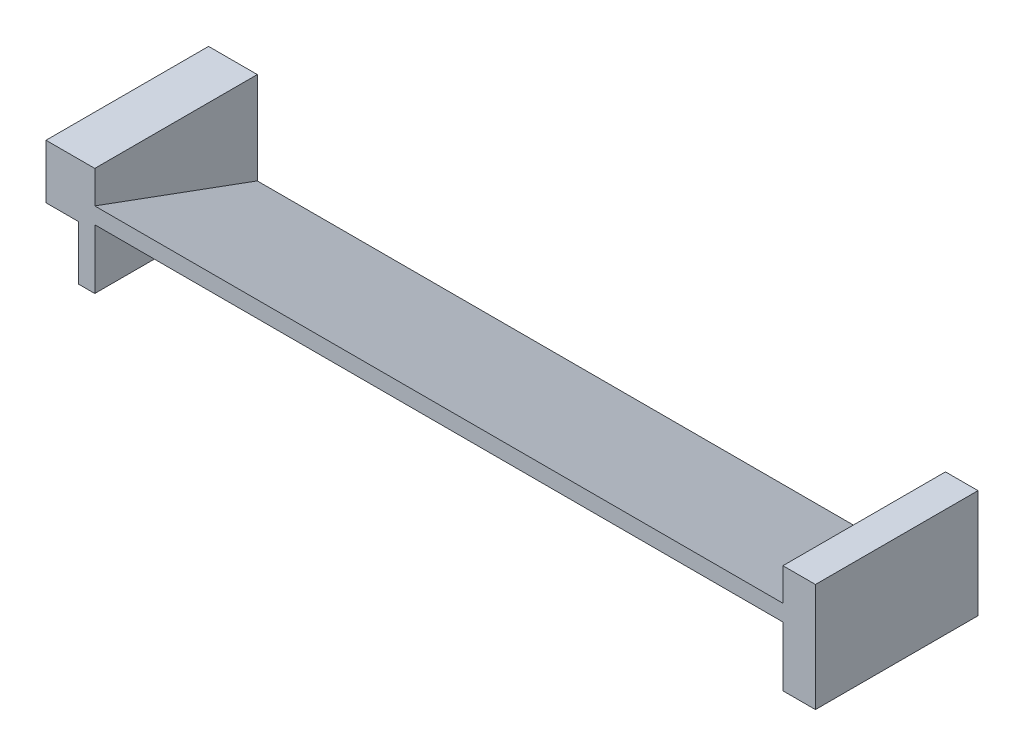
ISO-10303-21;
HEADER;
FILE_DESCRIPTION(('STEP AP214'),'2;1');
FILE_NAME('part.step','',(''),(''),'','','');
FILE_SCHEMA(('AUTOMOTIVE_DESIGN { 1 0 10303 214 1 1 1 1 }'));
ENDSEC;
DATA;
#1=APPLICATION_CONTEXT('core data for automotive mechanical design processes');
#2=APPLICATION_PROTOCOL_DEFINITION('international standard','automotive_design',2000,#1);
#3=PRODUCT_CONTEXT('',#1,'mechanical');
#4=PRODUCT('Part','Part','',(#3));
#5=PRODUCT_RELATED_PRODUCT_CATEGORY('part','',(#4));
#6=PRODUCT_DEFINITION_FORMATION('','',#4);
#7=PRODUCT_DEFINITION_CONTEXT('part definition',#1,'design');
#8=PRODUCT_DEFINITION('design','',#6,#7);
#9=PRODUCT_DEFINITION_SHAPE('','',#8);
#10=(LENGTH_UNIT() NAMED_UNIT(*) SI_UNIT(.MILLI.,.METRE.));
#11=(NAMED_UNIT(*) PLANE_ANGLE_UNIT() SI_UNIT($,.RADIAN.));
#12=(NAMED_UNIT(*) SI_UNIT($,.STERADIAN.) SOLID_ANGLE_UNIT());
#13=UNCERTAINTY_MEASURE_WITH_UNIT(LENGTH_MEASURE(1.E-05),#10,'distance_accuracy_value','');
#14=(GEOMETRIC_REPRESENTATION_CONTEXT(3) GLOBAL_UNCERTAINTY_ASSIGNED_CONTEXT((#13)) GLOBAL_UNIT_ASSIGNED_CONTEXT((#10,
#11,#12)) REPRESENTATION_CONTEXT('',''));
#15=CARTESIAN_POINT('',(0.,0.,0.));
#16=DIRECTION('',(0.,0.,1.));
#17=DIRECTION('',(1.,0.,0.));
#18=AXIS2_PLACEMENT_3D('',#15,#16,#17);
#19=CARTESIAN_POINT('',(65.,-10.,15.));
#20=DIRECTION('',(-1.,0.,0.));
#21=DIRECTION('',(0.,0.,1.));
#22=AXIS2_PLACEMENT_3D('',#19,#20,#21);
#23=PLANE('',#22);
#24=DIRECTION('',(0.,0.344254649158423,0.938876315886608));
#25=VECTOR('',#24,1.);
#26=CARTESIAN_POINT('',(65.,-9.,15.));
#27=LINE('',#26,#25);
#28=CARTESIAN_POINT('',(65.,-20.,-15.));
#29=VERTEX_POINT('',#28);
#30=CARTESIAN_POINT('',(65.,-9.,15.));
#31=VERTEX_POINT('',#30);
#32=EDGE_CURVE('E216',#29,#31,#27,.T.);
#33=ORIENTED_EDGE('',*,*,#32,.F.);
#34=DIRECTION('',(0.,0.,-1.));
#35=VECTOR('',#34,1.);
#36=CARTESIAN_POINT('',(65.,-20.,15.));
#37=LINE('',#36,#35);
#38=CARTESIAN_POINT('',(65.,-20.,15.));
#39=VERTEX_POINT('',#38);
#40=EDGE_CURVE('E220',#39,#29,#37,.T.);
#41=ORIENTED_EDGE('',*,*,#40,.F.);
#42=DIRECTION('',(0.,1.,0.));
#43=VECTOR('',#42,1.);
#44=CARTESIAN_POINT('',(65.,-10.,15.));
#45=LINE('',#44,#43);
#46=EDGE_CURVE('E69',#39,#31,#45,.T.);
#47=ORIENTED_EDGE('',*,*,#46,.T.);
#48=EDGE_LOOP('',(#33,#41,#47));
#49=FACE_BOUND('',#48,.T.);
#50=ADVANCED_FACE('F45',(#49),#23,.T.);
#51=CARTESIAN_POINT('',(71.,-10.,15.));
#52=DIRECTION('',(1.,0.,0.));
#53=DIRECTION('',(0.,0.,-1.));
#54=AXIS2_PLACEMENT_3D('',#51,#52,#53);
#55=PLANE('',#54);
#56=DIRECTION('',(0.,0.,-1.));
#57=VECTOR('',#56,1.);
#58=CARTESIAN_POINT('',(71.,0.,15.));
#59=LINE('',#58,#57);
#60=CARTESIAN_POINT('',(71.,0.,15.));
#61=VERTEX_POINT('',#60);
#62=CARTESIAN_POINT('',(71.,0.,-15.));
#63=VERTEX_POINT('',#62);
#64=EDGE_CURVE('E11',#61,#63,#59,.T.);
#65=ORIENTED_EDGE('',*,*,#64,.F.);
#66=DIRECTION('',(0.,1.,0.));
#67=VECTOR('',#66,1.);
#68=CARTESIAN_POINT('',(71.,-10.,15.));
#69=LINE('',#68,#67);
#70=CARTESIAN_POINT('',(71.,-20.,15.));
#71=VERTEX_POINT('',#70);
#72=EDGE_CURVE('E252',#71,#61,#69,.T.);
#73=ORIENTED_EDGE('',*,*,#72,.F.);
#74=DIRECTION('',(0.,0.,1.));
#75=VECTOR('',#74,1.);
#76=CARTESIAN_POINT('',(71.,-20.,15.));
#77=LINE('',#76,#75);
#78=CARTESIAN_POINT('',(71.,-20.,-15.));
#79=VERTEX_POINT('',#78);
#80=EDGE_CURVE('E244',#79,#71,#77,.T.);
#81=ORIENTED_EDGE('',*,*,#80,.F.);
#82=DIRECTION('',(0.,1.,0.));
#83=VECTOR('',#82,1.);
#84=CARTESIAN_POINT('',(71.,-10.,-15.));
#85=LINE('',#84,#83);
#86=EDGE_CURVE('E253',#79,#63,#85,.T.);
#87=ORIENTED_EDGE('',*,*,#86,.T.);
#88=EDGE_LOOP('',(#65,#73,#81,#87));
#89=FACE_BOUND('',#88,.T.);
#90=ADVANCED_FACE('F328',(#89),#55,.T.);
#91=CARTESIAN_POINT('',(71.,-10.,15.));
#92=DIRECTION('',(0.,0.,1.));
#93=DIRECTION('',(1.,0.,0.));
#94=AXIS2_PLACEMENT_3D('',#91,#92,#93);
#95=PLANE('',#94);
#96=DIRECTION('',(1.,0.,0.));
#97=VECTOR('',#96,1.);
#98=CARTESIAN_POINT('',(71.,0.,15.));
#99=LINE('',#98,#97);
#100=CARTESIAN_POINT('',(65.,0.,15.));
#101=VERTEX_POINT('',#100);
#102=EDGE_CURVE('E256',#101,#61,#99,.T.);
#103=ORIENTED_EDGE('',*,*,#102,.F.);
#104=CARTESIAN_POINT('',(65.,-6.,15.));
#105=VERTEX_POINT('',#104);
#106=EDGE_CURVE('E262',#105,#101,#45,.T.);
#107=ORIENTED_EDGE('',*,*,#106,.F.);
#108=DIRECTION('',(1.,0.,0.));
#109=VECTOR('',#108,1.);
#110=CARTESIAN_POINT('',(-71.002,-6.,15.));
#111=LINE('',#110,#109);
#112=CARTESIAN_POINT('',(-62.,-5.99999999999999,15.));
#113=VERTEX_POINT('',#112);
#114=EDGE_CURVE('E226',#113,#105,#111,.T.);
#115=ORIENTED_EDGE('',*,*,#114,.F.);
#116=DIRECTION('',(0.,-1.,0.));
#117=VECTOR('',#116,1.);
#118=CARTESIAN_POINT('',(-62.,0.,15.));
#119=LINE('',#118,#117);
#120=CARTESIAN_POINT('',(-62.,0.,15.));
#121=VERTEX_POINT('',#120);
#122=EDGE_CURVE('E151',#121,#113,#119,.T.);
#123=ORIENTED_EDGE('',*,*,#122,.F.);
#124=DIRECTION('',(1.,0.,0.));
#125=VECTOR('',#124,1.);
#126=CARTESIAN_POINT('',(-71.,0.,15.));
#127=LINE('',#126,#125);
#128=CARTESIAN_POINT('',(-71.,0.,15.));
#129=VERTEX_POINT('',#128);
#130=EDGE_CURVE('E187',#129,#121,#127,.T.);
#131=ORIENTED_EDGE('',*,*,#130,.F.);
#132=DIRECTION('',(0.,1.,0.));
#133=VECTOR('',#132,1.);
#134=CARTESIAN_POINT('',(-71.,-10.,15.));
#135=LINE('',#134,#133);
#136=CARTESIAN_POINT('',(-71.,-10.,15.));
#137=VERTEX_POINT('',#136);
#138=EDGE_CURVE('E204',#137,#129,#135,.T.);
#139=ORIENTED_EDGE('',*,*,#138,.F.);
#140=DIRECTION('',(1.,0.,0.));
#141=VECTOR('',#140,1.);
#142=CARTESIAN_POINT('',(-71.,-10.,15.));
#143=LINE('',#142,#141);
#144=CARTESIAN_POINT('',(-65.,-10.,15.));
#145=VERTEX_POINT('',#144);
#146=EDGE_CURVE('E195',#137,#145,#143,.T.);
#147=ORIENTED_EDGE('',*,*,#146,.T.);
#148=DIRECTION('',(0.,-1.,0.));
#149=VECTOR('',#148,1.);
#150=CARTESIAN_POINT('',(-65.,0.,15.));
#151=LINE('',#150,#149);
#152=CARTESIAN_POINT('',(-65.,-20.,15.));
#153=VERTEX_POINT('',#152);
#154=EDGE_CURVE('E168',#145,#153,#151,.T.);
#155=ORIENTED_EDGE('',*,*,#154,.T.);
#156=DIRECTION('',(-1.,0.,0.));
#157=VECTOR('',#156,1.);
#158=CARTESIAN_POINT('',(-62.,-20.,15.));
#159=LINE('',#158,#157);
#160=CARTESIAN_POINT('',(-62.,-20.,15.));
#161=VERTEX_POINT('',#160);
#162=EDGE_CURVE('E158',#161,#153,#159,.T.);
#163=ORIENTED_EDGE('',*,*,#162,.F.);
#164=CARTESIAN_POINT('',(-62.,-8.99999999999999,15.));
#165=VERTEX_POINT('',#164);
#166=EDGE_CURVE('E141',#165,#161,#119,.T.);
#167=ORIENTED_EDGE('',*,*,#166,.F.);
#168=DIRECTION('',(1.,0.,0.));
#169=VECTOR('',#168,1.);
#170=CARTESIAN_POINT('',(-71.002,-9.,15.));
#171=LINE('',#170,#169);
#172=EDGE_CURVE('E215',#165,#31,#171,.T.);
#173=ORIENTED_EDGE('',*,*,#172,.T.);
#174=ORIENTED_EDGE('',*,*,#46,.F.);
#175=DIRECTION('',(-1.,0.,0.));
#176=VECTOR('',#175,1.);
#177=CARTESIAN_POINT('',(65.,-20.,15.));
#178=LINE('',#177,#176);
#179=EDGE_CURVE('E248',#71,#39,#178,.T.);
#180=ORIENTED_EDGE('',*,*,#179,.F.);
#181=ORIENTED_EDGE('',*,*,#72,.T.);
#182=EDGE_LOOP('',(#103,#107,#115,#123,#131,#139,#147,#155,#163,#167,#173,#174,#180,#181));
#183=FACE_BOUND('',#182,.T.);
#184=ADVANCED_FACE('F165',(#183),#95,.T.);
#185=DIRECTION('',(0.,-0.344254649158423,-0.938876315886608));
#186=VECTOR('',#185,1.);
#187=CARTESIAN_POINT('',(65.,-17.,-15.));
#188=LINE('',#187,#186);
#189=CARTESIAN_POINT('',(65.,-17.,-15.));
#190=VERTEX_POINT('',#189);
#191=EDGE_CURVE('E61',#105,#190,#188,.T.);
#192=ORIENTED_EDGE('',*,*,#191,.F.);
#193=ORIENTED_EDGE('',*,*,#106,.T.);
#194=DIRECTION('',(0.,0.,1.));
#195=VECTOR('',#194,1.);
#196=CARTESIAN_POINT('',(65.,0.,15.));
#197=LINE('',#196,#195);
#198=CARTESIAN_POINT('',(65.,0.,-15.));
#199=VERTEX_POINT('',#198);
#200=EDGE_CURVE('E268',#199,#101,#197,.T.);
#201=ORIENTED_EDGE('',*,*,#200,.F.);
#202=DIRECTION('',(0.,1.,0.));
#203=VECTOR('',#202,1.);
#204=CARTESIAN_POINT('',(65.,-10.,-15.));
#205=LINE('',#204,#203);
#206=EDGE_CURVE('E257',#190,#199,#205,.T.);
#207=ORIENTED_EDGE('',*,*,#206,.F.);
#208=EDGE_LOOP('',(#192,#193,#201,#207));
#209=FACE_BOUND('',#208,.T.);
#210=ADVANCED_FACE('F282',(#209),#23,.T.);
#211=CARTESIAN_POINT('',(71.,-10.,-15.));
#212=DIRECTION('',(0.,0.,-1.));
#213=DIRECTION('',(-1.,0.,0.));
#214=AXIS2_PLACEMENT_3D('',#211,#212,#213);
#215=PLANE('',#214);
#216=DIRECTION('',(-1.,0.,0.));
#217=VECTOR('',#216,1.);
#218=CARTESIAN_POINT('',(71.,0.,-15.));
#219=LINE('',#218,#217);
#220=EDGE_CURVE('E54',#63,#199,#219,.T.);
#221=ORIENTED_EDGE('',*,*,#220,.F.);
#222=ORIENTED_EDGE('',*,*,#86,.F.);
#223=DIRECTION('',(1.,0.,0.));
#224=VECTOR('',#223,1.);
#225=CARTESIAN_POINT('',(65.,-20.,-15.));
#226=LINE('',#225,#224);
#227=EDGE_CURVE('E240',#29,#79,#226,.T.);
#228=ORIENTED_EDGE('',*,*,#227,.F.);
#229=DIRECTION('',(1.,0.,0.));
#230=VECTOR('',#229,1.);
#231=CARTESIAN_POINT('',(-71.002,-20.,-15.));
#232=LINE('',#231,#230);
#233=CARTESIAN_POINT('',(-62.,-20.,-15.));
#234=VERTEX_POINT('',#233);
#235=EDGE_CURVE('E223',#234,#29,#232,.T.);
#236=ORIENTED_EDGE('',*,*,#235,.F.);
#237=DIRECTION('',(-1.,0.,0.));
#238=VECTOR('',#237,1.);
#239=CARTESIAN_POINT('',(-62.,-20.,-15.));
#240=LINE('',#239,#238);
#241=CARTESIAN_POINT('',(-65.,-20.,-15.));
#242=VERTEX_POINT('',#241);
#243=EDGE_CURVE('E160',#234,#242,#240,.T.);
#244=ORIENTED_EDGE('',*,*,#243,.T.);
#245=DIRECTION('',(0.,1.,0.));
#246=VECTOR('',#245,1.);
#247=CARTESIAN_POINT('',(-65.,0.,-15.));
#248=LINE('',#247,#246);
#249=CARTESIAN_POINT('',(-65.,-10.,-15.));
#250=VERTEX_POINT('',#249);
#251=EDGE_CURVE('E152',#242,#250,#248,.T.);
#252=ORIENTED_EDGE('',*,*,#251,.T.);
#253=DIRECTION('',(-1.,0.,0.));
#254=VECTOR('',#253,1.);
#255=CARTESIAN_POINT('',(-71.,-10.,-15.));
#256=LINE('',#255,#254);
#257=CARTESIAN_POINT('',(-71.,-10.,-15.));
#258=VERTEX_POINT('',#257);
#259=EDGE_CURVE('E186',#250,#258,#256,.T.);
#260=ORIENTED_EDGE('',*,*,#259,.T.);
#261=DIRECTION('',(0.,1.,0.));
#262=VECTOR('',#261,1.);
#263=CARTESIAN_POINT('',(-71.,-10.,-15.));
#264=LINE('',#263,#262);
#265=CARTESIAN_POINT('',(-71.,0.,-15.));
#266=VERTEX_POINT('',#265);
#267=EDGE_CURVE('E197',#258,#266,#264,.T.);
#268=ORIENTED_EDGE('',*,*,#267,.T.);
#269=DIRECTION('',(-1.,0.,0.));
#270=VECTOR('',#269,1.);
#271=CARTESIAN_POINT('',(-71.,0.,-15.));
#272=LINE('',#271,#270);
#273=CARTESIAN_POINT('',(-62.,0.,-15.));
#274=VERTEX_POINT('',#273);
#275=EDGE_CURVE('E171',#274,#266,#272,.T.);
#276=ORIENTED_EDGE('',*,*,#275,.F.);
#277=DIRECTION('',(0.,1.,0.));
#278=VECTOR('',#277,1.);
#279=CARTESIAN_POINT('',(-62.,-14.,-15.));
#280=LINE('',#279,#278);
#281=CARTESIAN_POINT('',(-62.,-17.,-15.));
#282=VERTEX_POINT('',#281);
#283=EDGE_CURVE('E162',#282,#274,#280,.T.);
#284=ORIENTED_EDGE('',*,*,#283,.F.);
#285=DIRECTION('',(1.,0.,0.));
#286=VECTOR('',#285,1.);
#287=CARTESIAN_POINT('',(-71.002,-17.,-15.));
#288=LINE('',#287,#286);
#289=EDGE_CURVE('E230',#282,#190,#288,.T.);
#290=ORIENTED_EDGE('',*,*,#289,.T.);
#291=ORIENTED_EDGE('',*,*,#206,.T.);
#292=EDGE_LOOP('',(#221,#222,#228,#236,#244,#252,#260,#268,#276,#284,#290,#291));
#293=FACE_BOUND('',#292,.T.);
#294=ADVANCED_FACE('F278',(#293),#215,.T.);
#295=CARTESIAN_POINT('',(0.,0.,0.));
#296=DIRECTION('',(0.,1.,0.));
#297=DIRECTION('',(0.,0.,1.));
#298=AXIS2_PLACEMENT_3D('',#295,#296,#297);
#299=PLANE('',#298);
#300=ORIENTED_EDGE('',*,*,#64,.T.);
#301=ORIENTED_EDGE('',*,*,#220,.T.);
#302=ORIENTED_EDGE('',*,*,#200,.T.);
#303=ORIENTED_EDGE('',*,*,#102,.T.);
#304=EDGE_LOOP('',(#300,#301,#302,#303));
#305=FACE_BOUND('',#304,.T.);
#306=ADVANCED_FACE('F47',(#305),#299,.T.);
#307=CARTESIAN_POINT('',(0.,-20.,0.));
#308=DIRECTION('',(0.,-1.,0.));
#309=DIRECTION('',(0.,0.,-1.));
#310=AXIS2_PLACEMENT_3D('',#307,#308,#309);
#311=PLANE('',#310);
#312=ORIENTED_EDGE('',*,*,#40,.T.);
#313=ORIENTED_EDGE('',*,*,#227,.T.);
#314=ORIENTED_EDGE('',*,*,#80,.T.);
#315=ORIENTED_EDGE('',*,*,#179,.T.);
#316=EDGE_LOOP('',(#312,#313,#314,#315));
#317=FACE_BOUND('',#316,.T.);
#318=ADVANCED_FACE('F365',(#317),#311,.T.);
#319=CARTESIAN_POINT('',(-71.002,-17.,-15.));
#320=DIRECTION('',(0.,-0.938876315886608,0.344254649158423));
#321=DIRECTION('',(0.,-0.344254649158424,-0.938876315886609));
#322=AXIS2_PLACEMENT_3D('',#319,#320,#321);
#323=PLANE('',#322);
#324=ORIENTED_EDGE('',*,*,#289,.F.);
#325=DIRECTION('',(0.,0.344254649158424,0.938876315886609));
#326=VECTOR('',#325,1.);
#327=CARTESIAN_POINT('',(-62.,-17.,-15.));
#328=LINE('',#327,#326);
#329=EDGE_CURVE('E211',#282,#113,#328,.T.);
#330=ORIENTED_EDGE('',*,*,#329,.T.);
#331=ORIENTED_EDGE('',*,*,#114,.T.);
#332=ORIENTED_EDGE('',*,*,#191,.T.);
#333=EDGE_LOOP('',(#324,#330,#331,#332));
#334=FACE_BOUND('',#333,.T.);
#335=ADVANCED_FACE('F287',(#334),#323,.F.);
#336=CARTESIAN_POINT('',(-71.002,-9.,15.));
#337=DIRECTION('',(0.,0.938876315886609,-0.344254649158423));
#338=DIRECTION('',(0.,0.344254649158423,0.938876315886609));
#339=AXIS2_PLACEMENT_3D('',#336,#337,#338);
#340=PLANE('',#339);
#341=ORIENTED_EDGE('',*,*,#172,.F.);
#342=DIRECTION('',(0.,-0.344254649158423,-0.938876315886609));
#343=VECTOR('',#342,1.);
#344=CARTESIAN_POINT('',(-62.,-9.,15.));
#345=LINE('',#344,#343);
#346=EDGE_CURVE('E146',#165,#234,#345,.T.);
#347=ORIENTED_EDGE('',*,*,#346,.T.);
#348=ORIENTED_EDGE('',*,*,#235,.T.);
#349=ORIENTED_EDGE('',*,*,#32,.T.);
#350=EDGE_LOOP('',(#341,#347,#348,#349));
#351=FACE_BOUND('',#350,.T.);
#352=ADVANCED_FACE('F364',(#351),#340,.F.);
#353=CARTESIAN_POINT('',(-62.,0.,0.));
#354=DIRECTION('',(1.,0.,0.));
#355=DIRECTION('',(0.,0.,-1.));
#356=AXIS2_PLACEMENT_3D('',#353,#354,#355);
#357=PLANE('',#356);
#358=ORIENTED_EDGE('',*,*,#329,.F.);
#359=ORIENTED_EDGE('',*,*,#283,.T.);
#360=DIRECTION('',(0.,0.,1.));
#361=VECTOR('',#360,1.);
#362=CARTESIAN_POINT('',(-62.,0.,15.));
#363=LINE('',#362,#361);
#364=EDGE_CURVE('E178',#274,#121,#363,.T.);
#365=ORIENTED_EDGE('',*,*,#364,.T.);
#366=ORIENTED_EDGE('',*,*,#122,.T.);
#367=EDGE_LOOP('',(#358,#359,#365,#366));
#368=FACE_BOUND('',#367,.T.);
#369=ADVANCED_FACE('F289',(#368),#357,.T.);
#370=ORIENTED_EDGE('',*,*,#346,.F.);
#371=ORIENTED_EDGE('',*,*,#166,.T.);
#372=DIRECTION('',(0.,0.,-1.));
#373=VECTOR('',#372,1.);
#374=CARTESIAN_POINT('',(-62.,-20.,15.));
#375=LINE('',#374,#373);
#376=EDGE_CURVE('E144',#161,#234,#375,.T.);
#377=ORIENTED_EDGE('',*,*,#376,.T.);
#378=EDGE_LOOP('',(#370,#371,#377));
#379=FACE_BOUND('',#378,.T.);
#380=ADVANCED_FACE('F143',(#379),#357,.T.);
#381=CARTESIAN_POINT('',(-71.,-10.,15.));
#382=DIRECTION('',(-1.,0.,0.));
#383=DIRECTION('',(0.,0.,1.));
#384=AXIS2_PLACEMENT_3D('',#381,#382,#383);
#385=PLANE('',#384);
#386=DIRECTION('',(0.,0.,1.));
#387=VECTOR('',#386,1.);
#388=CARTESIAN_POINT('',(-71.,0.,15.));
#389=LINE('',#388,#387);
#390=EDGE_CURVE('E176',#266,#129,#389,.T.);
#391=ORIENTED_EDGE('',*,*,#390,.F.);
#392=ORIENTED_EDGE('',*,*,#267,.F.);
#393=DIRECTION('',(0.,0.,1.));
#394=VECTOR('',#393,1.);
#395=CARTESIAN_POINT('',(-71.,-10.,15.));
#396=LINE('',#395,#394);
#397=EDGE_CURVE('E191',#258,#137,#396,.T.);
#398=ORIENTED_EDGE('',*,*,#397,.T.);
#399=ORIENTED_EDGE('',*,*,#138,.T.);
#400=EDGE_LOOP('',(#391,#392,#398,#399));
#401=FACE_BOUND('',#400,.T.);
#402=ADVANCED_FACE('F314',(#401),#385,.T.);
#403=CARTESIAN_POINT('',(0.,-10.,0.));
#404=DIRECTION('',(0.,-1.,0.));
#405=DIRECTION('',(0.,0.,-1.));
#406=AXIS2_PLACEMENT_3D('',#403,#404,#405);
#407=PLANE('',#406);
#408=DIRECTION('',(0.,0.,-1.));
#409=VECTOR('',#408,1.);
#410=CARTESIAN_POINT('',(-65.,-10.,15.));
#411=LINE('',#410,#409);
#412=EDGE_CURVE('E182',#145,#250,#411,.T.);
#413=ORIENTED_EDGE('',*,*,#412,.F.);
#414=ORIENTED_EDGE('',*,*,#146,.F.);
#415=ORIENTED_EDGE('',*,*,#397,.F.);
#416=ORIENTED_EDGE('',*,*,#259,.F.);
#417=EDGE_LOOP('',(#413,#414,#415,#416));
#418=FACE_BOUND('',#417,.T.);
#419=ADVANCED_FACE('F309',(#418),#407,.T.);
#420=CARTESIAN_POINT('',(0.,0.,0.));
#421=DIRECTION('',(0.,-1.,0.));
#422=DIRECTION('',(0.,0.,-1.));
#423=AXIS2_PLACEMENT_3D('',#420,#421,#422);
#424=PLANE('',#423);
#425=ORIENTED_EDGE('',*,*,#130,.T.);
#426=ORIENTED_EDGE('',*,*,#364,.F.);
#427=ORIENTED_EDGE('',*,*,#275,.T.);
#428=ORIENTED_EDGE('',*,*,#390,.T.);
#429=EDGE_LOOP('',(#425,#426,#427,#428));
#430=FACE_BOUND('',#429,.T.);
#431=ADVANCED_FACE('F316',(#430),#424,.F.);
#432=CARTESIAN_POINT('',(-65.,0.,0.));
#433=DIRECTION('',(1.,0.,0.));
#434=DIRECTION('',(0.,0.,-1.));
#435=AXIS2_PLACEMENT_3D('',#432,#433,#434);
#436=PLANE('',#435);
#437=ORIENTED_EDGE('',*,*,#154,.F.);
#438=ORIENTED_EDGE('',*,*,#412,.T.);
#439=ORIENTED_EDGE('',*,*,#251,.F.);
#440=DIRECTION('',(0.,0.,-1.));
#441=VECTOR('',#440,1.);
#442=CARTESIAN_POINT('',(-65.,-20.,15.));
#443=LINE('',#442,#441);
#444=EDGE_CURVE('E300',#153,#242,#443,.T.);
#445=ORIENTED_EDGE('',*,*,#444,.F.);
#446=EDGE_LOOP('',(#437,#438,#439,#445));
#447=FACE_BOUND('',#446,.T.);
#448=ADVANCED_FACE('F306',(#447),#436,.F.);
#449=CARTESIAN_POINT('',(-62.,-20.,15.));
#450=DIRECTION('',(0.,1.,0.));
#451=DIRECTION('',(0.,0.,1.));
#452=AXIS2_PLACEMENT_3D('',#449,#450,#451);
#453=PLANE('',#452);
#454=ORIENTED_EDGE('',*,*,#444,.T.);
#455=ORIENTED_EDGE('',*,*,#243,.F.);
#456=ORIENTED_EDGE('',*,*,#376,.F.);
#457=ORIENTED_EDGE('',*,*,#162,.T.);
#458=EDGE_LOOP('',(#454,#455,#456,#457));
#459=FACE_BOUND('',#458,.T.);
#460=ADVANCED_FACE('F157',(#459),#453,.F.);
#461=CLOSED_SHELL('',(#50,#90,#184,#210,#294,#306,#318,#335,#352,#369,#380,#402,#419,#431,#448,#460));
#462=MANIFOLD_SOLID_BREP('B2',#461);
#463=ADVANCED_BREP_SHAPE_REPRESENTATION('',(#18,#462),#14);
#464=SHAPE_DEFINITION_REPRESENTATION(#9,#463);
ENDSEC;
END-ISO-10303-21;
